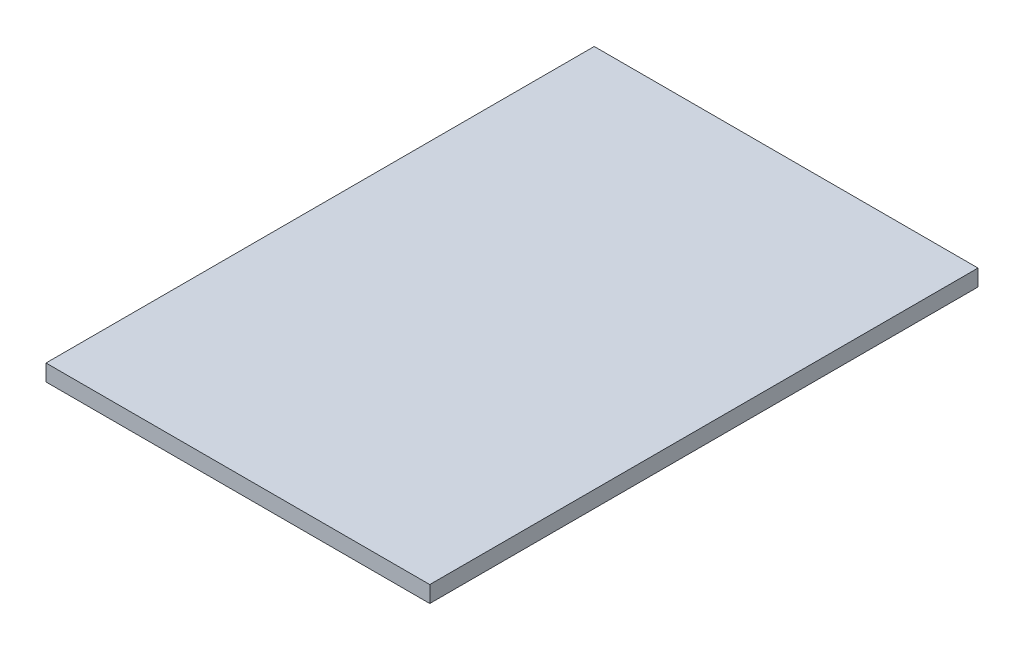
ISO-10303-21;
HEADER;
FILE_DESCRIPTION(('STEP AP214'),'2;1');
FILE_NAME('part.step','',(''),(''),'','','');
FILE_SCHEMA(('AUTOMOTIVE_DESIGN { 1 0 10303 214 1 1 1 1 }'));
ENDSEC;
DATA;
#1=APPLICATION_CONTEXT('core data for automotive mechanical design processes');
#2=APPLICATION_PROTOCOL_DEFINITION('international standard','automotive_design',2000,#1);
#3=PRODUCT_CONTEXT('',#1,'mechanical');
#4=PRODUCT('Part','Part','',(#3));
#5=PRODUCT_RELATED_PRODUCT_CATEGORY('part','',(#4));
#6=PRODUCT_DEFINITION_FORMATION('','',#4);
#7=PRODUCT_DEFINITION_CONTEXT('part definition',#1,'design');
#8=PRODUCT_DEFINITION('design','',#6,#7);
#9=PRODUCT_DEFINITION_SHAPE('','',#8);
#10=(LENGTH_UNIT() NAMED_UNIT(*) SI_UNIT(.MILLI.,.METRE.));
#11=(NAMED_UNIT(*) PLANE_ANGLE_UNIT() SI_UNIT($,.RADIAN.));
#12=(NAMED_UNIT(*) SI_UNIT($,.STERADIAN.) SOLID_ANGLE_UNIT());
#13=UNCERTAINTY_MEASURE_WITH_UNIT(LENGTH_MEASURE(1.E-05),#10,'distance_accuracy_value','');
#14=(GEOMETRIC_REPRESENTATION_CONTEXT(3) GLOBAL_UNCERTAINTY_ASSIGNED_CONTEXT((#13)) GLOBAL_UNIT_ASSIGNED_CONTEXT((#10,
#11,#12)) REPRESENTATION_CONTEXT('',''));
#15=CARTESIAN_POINT('',(0.,0.,0.));
#16=DIRECTION('',(0.,0.,1.));
#17=DIRECTION('',(1.,0.,0.));
#18=AXIS2_PLACEMENT_3D('',#15,#16,#17);
#19=CARTESIAN_POINT('',(350.,20.,-500.));
#20=DIRECTION('',(-1.,0.,0.));
#21=DIRECTION('',(0.,0.,1.));
#22=AXIS2_PLACEMENT_3D('',#19,#20,#21);
#23=PLANE('',#22);
#24=DIRECTION('',(0.,-1.,0.));
#25=VECTOR('',#24,1.);
#26=CARTESIAN_POINT('',(350.,20.,500.));
#27=LINE('',#26,#25);
#28=CARTESIAN_POINT('',(350.,20.,500.));
#29=VERTEX_POINT('',#28);
#30=CARTESIAN_POINT('',(350.,-10.,500.));
#31=VERTEX_POINT('',#30);
#32=EDGE_CURVE('E76',#29,#31,#27,.T.);
#33=ORIENTED_EDGE('',*,*,#32,.T.);
#34=DIRECTION('',(0.,0.,1.));
#35=VECTOR('',#34,1.);
#36=CARTESIAN_POINT('',(350.,-10.,500.));
#37=LINE('',#36,#35);
#38=CARTESIAN_POINT('',(350.,-10.,-500.));
#39=VERTEX_POINT('',#38);
#40=EDGE_CURVE('E80',#39,#31,#37,.T.);
#41=ORIENTED_EDGE('',*,*,#40,.F.);
#42=DIRECTION('',(0.,-1.,0.));
#43=VECTOR('',#42,1.);
#44=CARTESIAN_POINT('',(350.,20.,-500.));
#45=LINE('',#44,#43);
#46=CARTESIAN_POINT('',(350.,20.,-500.));
#47=VERTEX_POINT('',#46);
#48=EDGE_CURVE('E11',#47,#39,#45,.T.);
#49=ORIENTED_EDGE('',*,*,#48,.F.);
#50=DIRECTION('',(0.,0.,-1.));
#51=VECTOR('',#50,1.);
#52=CARTESIAN_POINT('',(350.,20.,-500.));
#53=LINE('',#52,#51);
#54=EDGE_CURVE('E81',#29,#47,#53,.T.);
#55=ORIENTED_EDGE('',*,*,#54,.F.);
#56=EDGE_LOOP('',(#33,#41,#49,#55));
#57=FACE_BOUND('',#56,.T.);
#58=ADVANCED_FACE('F37',(#57),#23,.F.);
#59=CARTESIAN_POINT('',(-350.,20.,-500.));
#60=DIRECTION('',(0.,0.,1.));
#61=DIRECTION('',(1.,0.,0.));
#62=AXIS2_PLACEMENT_3D('',#59,#60,#61);
#63=PLANE('',#62);
#64=ORIENTED_EDGE('',*,*,#48,.T.);
#65=DIRECTION('',(1.,0.,0.));
#66=VECTOR('',#65,1.);
#67=CARTESIAN_POINT('',(-350.,-10.,-500.));
#68=LINE('',#67,#66);
#69=CARTESIAN_POINT('',(-350.,-10.,-500.));
#70=VERTEX_POINT('',#69);
#71=EDGE_CURVE('E96',#70,#39,#68,.T.);
#72=ORIENTED_EDGE('',*,*,#71,.F.);
#73=DIRECTION('',(0.,-1.,0.));
#74=VECTOR('',#73,1.);
#75=CARTESIAN_POINT('',(-350.,20.,-500.));
#76=LINE('',#75,#74);
#77=CARTESIAN_POINT('',(-350.,20.,-500.));
#78=VERTEX_POINT('',#77);
#79=EDGE_CURVE('E44',#78,#70,#76,.T.);
#80=ORIENTED_EDGE('',*,*,#79,.F.);
#81=DIRECTION('',(-1.,0.,0.));
#82=VECTOR('',#81,1.);
#83=CARTESIAN_POINT('',(-350.,20.,-500.));
#84=LINE('',#83,#82);
#85=EDGE_CURVE('E102',#47,#78,#84,.T.);
#86=ORIENTED_EDGE('',*,*,#85,.F.);
#87=EDGE_LOOP('',(#64,#72,#80,#86));
#88=FACE_BOUND('',#87,.T.);
#89=ADVANCED_FACE('F110',(#88),#63,.F.);
#90=CARTESIAN_POINT('',(-350.,20.,-500.));
#91=DIRECTION('',(1.,0.,0.));
#92=DIRECTION('',(0.,0.,-1.));
#93=AXIS2_PLACEMENT_3D('',#90,#91,#92);
#94=PLANE('',#93);
#95=ORIENTED_EDGE('',*,*,#79,.T.);
#96=DIRECTION('',(0.,0.,-1.));
#97=VECTOR('',#96,1.);
#98=CARTESIAN_POINT('',(-350.,-10.,500.));
#99=LINE('',#98,#97);
#100=CARTESIAN_POINT('',(-350.,-10.,500.));
#101=VERTEX_POINT('',#100);
#102=EDGE_CURVE('E91',#101,#70,#99,.T.);
#103=ORIENTED_EDGE('',*,*,#102,.F.);
#104=DIRECTION('',(0.,-1.,0.));
#105=VECTOR('',#104,1.);
#106=CARTESIAN_POINT('',(-350.,20.,500.));
#107=LINE('',#106,#105);
#108=CARTESIAN_POINT('',(-350.,20.,500.));
#109=VERTEX_POINT('',#108);
#110=EDGE_CURVE('E83',#109,#101,#107,.T.);
#111=ORIENTED_EDGE('',*,*,#110,.F.);
#112=DIRECTION('',(0.,0.,1.));
#113=VECTOR('',#112,1.);
#114=CARTESIAN_POINT('',(-350.,20.,-500.));
#115=LINE('',#114,#113);
#116=EDGE_CURVE('E56',#78,#109,#115,.T.);
#117=ORIENTED_EDGE('',*,*,#116,.F.);
#118=EDGE_LOOP('',(#95,#103,#111,#117));
#119=FACE_BOUND('',#118,.T.);
#120=ADVANCED_FACE('F108',(#119),#94,.F.);
#121=CARTESIAN_POINT('',(-350.,20.,500.));
#122=DIRECTION('',(0.,0.,-1.));
#123=DIRECTION('',(-1.,0.,0.));
#124=AXIS2_PLACEMENT_3D('',#121,#122,#123);
#125=PLANE('',#124);
#126=ORIENTED_EDGE('',*,*,#110,.T.);
#127=DIRECTION('',(-1.,0.,0.));
#128=VECTOR('',#127,1.);
#129=CARTESIAN_POINT('',(-350.,-10.,500.));
#130=LINE('',#129,#128);
#131=EDGE_CURVE('E86',#31,#101,#130,.T.);
#132=ORIENTED_EDGE('',*,*,#131,.F.);
#133=ORIENTED_EDGE('',*,*,#32,.F.);
#134=DIRECTION('',(1.,0.,0.));
#135=VECTOR('',#134,1.);
#136=CARTESIAN_POINT('',(-350.,20.,500.));
#137=LINE('',#136,#135);
#138=EDGE_CURVE('E51',#109,#29,#137,.T.);
#139=ORIENTED_EDGE('',*,*,#138,.F.);
#140=EDGE_LOOP('',(#126,#132,#133,#139));
#141=FACE_BOUND('',#140,.T.);
#142=ADVANCED_FACE('F87',(#141),#125,.F.);
#143=CARTESIAN_POINT('',(0.,20.,0.));
#144=DIRECTION('',(0.,1.,0.));
#145=DIRECTION('',(0.,0.,1.));
#146=AXIS2_PLACEMENT_3D('',#143,#144,#145);
#147=PLANE('',#146);
#148=ORIENTED_EDGE('',*,*,#54,.T.);
#149=ORIENTED_EDGE('',*,*,#85,.T.);
#150=ORIENTED_EDGE('',*,*,#116,.T.);
#151=ORIENTED_EDGE('',*,*,#138,.T.);
#152=EDGE_LOOP('',(#148,#149,#150,#151));
#153=FACE_BOUND('',#152,.T.);
#154=ADVANCED_FACE('F111',(#153),#147,.T.);
#155=CARTESIAN_POINT('',(0.,-10.,0.));
#156=DIRECTION('',(0.,-1.,0.));
#157=DIRECTION('',(0.,0.,-1.));
#158=AXIS2_PLACEMENT_3D('',#155,#156,#157);
#159=PLANE('',#158);
#160=ORIENTED_EDGE('',*,*,#40,.T.);
#161=ORIENTED_EDGE('',*,*,#131,.T.);
#162=ORIENTED_EDGE('',*,*,#102,.T.);
#163=ORIENTED_EDGE('',*,*,#71,.T.);
#164=EDGE_LOOP('',(#160,#161,#162,#163));
#165=FACE_BOUND('',#164,.T.);
#166=ADVANCED_FACE('F94',(#165),#159,.T.);
#167=CLOSED_SHELL('',(#58,#89,#120,#142,#154,#166));
#168=MANIFOLD_SOLID_BREP('B2',#167);
#169=ADVANCED_BREP_SHAPE_REPRESENTATION('',(#18,#168),#14);
#170=SHAPE_DEFINITION_REPRESENTATION(#9,#169);
ENDSEC;
END-ISO-10303-21;
